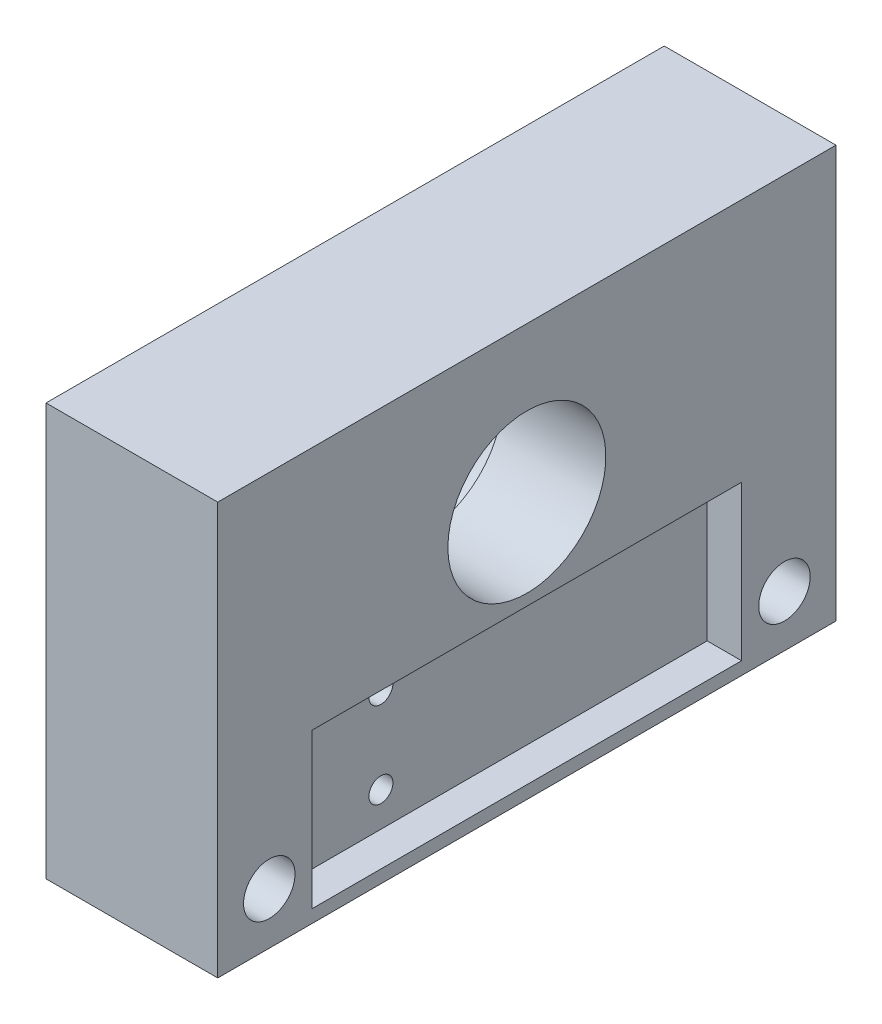
ISO-10303-21;
HEADER;
FILE_DESCRIPTION(('STEP AP214'),'2;1');
FILE_NAME('part.step','',(''),(''),'','','');
FILE_SCHEMA(('AUTOMOTIVE_DESIGN { 1 0 10303 214 1 1 1 1 }'));
ENDSEC;
DATA;
#1=APPLICATION_CONTEXT('core data for automotive mechanical design processes');
#2=APPLICATION_PROTOCOL_DEFINITION('international standard','automotive_design',2000,#1);
#3=PRODUCT_CONTEXT('',#1,'mechanical');
#4=PRODUCT('Part','Part','',(#3));
#5=PRODUCT_RELATED_PRODUCT_CATEGORY('part','',(#4));
#6=PRODUCT_DEFINITION_FORMATION('','',#4);
#7=PRODUCT_DEFINITION_CONTEXT('part definition',#1,'design');
#8=PRODUCT_DEFINITION('design','',#6,#7);
#9=PRODUCT_DEFINITION_SHAPE('','',#8);
#10=(LENGTH_UNIT() NAMED_UNIT(*) SI_UNIT(.MILLI.,.METRE.));
#11=(NAMED_UNIT(*) PLANE_ANGLE_UNIT() SI_UNIT($,.RADIAN.));
#12=(NAMED_UNIT(*) SI_UNIT($,.STERADIAN.) SOLID_ANGLE_UNIT());
#13=UNCERTAINTY_MEASURE_WITH_UNIT(LENGTH_MEASURE(1.E-05),#10,'distance_accuracy_value','');
#14=(GEOMETRIC_REPRESENTATION_CONTEXT(3) GLOBAL_UNCERTAINTY_ASSIGNED_CONTEXT((#13)) GLOBAL_UNIT_ASSIGNED_CONTEXT((#10,
#11,#12)) REPRESENTATION_CONTEXT('',''));
#15=CARTESIAN_POINT('',(0.,0.,0.));
#16=DIRECTION('',(0.,0.,1.));
#17=DIRECTION('',(1.,0.,0.));
#18=AXIS2_PLACEMENT_3D('',#15,#16,#17);
#19=CARTESIAN_POINT('',(10.,0.,0.));
#20=DIRECTION('',(0.,0.,-1.));
#21=DIRECTION('',(0.,1.,0.));
#22=AXIS2_PLACEMENT_3D('',#19,#20,#21);
#23=PLANE('',#22);
#24=DIRECTION('',(0.,-1.,0.));
#25=VECTOR('',#24,1.);
#26=CARTESIAN_POINT('',(0.,0.,0.));
#27=LINE('',#26,#25);
#28=CARTESIAN_POINT('',(0.,0.,0.));
#29=VERTEX_POINT('',#28);
#30=CARTESIAN_POINT('',(0.,-24.,0.));
#31=VERTEX_POINT('',#30);
#32=EDGE_CURVE('E175',#29,#31,#27,.T.);
#33=ORIENTED_EDGE('',*,*,#32,.T.);
#34=DIRECTION('',(-1.,0.,0.));
#35=VECTOR('',#34,1.);
#36=CARTESIAN_POINT('',(10.,-24.,0.));
#37=LINE('',#36,#35);
#38=CARTESIAN_POINT('',(10.,-24.,0.));
#39=VERTEX_POINT('',#38);
#40=EDGE_CURVE('E11',#39,#31,#37,.T.);
#41=ORIENTED_EDGE('',*,*,#40,.F.);
#42=DIRECTION('',(0.,-1.,0.));
#43=VECTOR('',#42,1.);
#44=CARTESIAN_POINT('',(10.,0.,0.));
#45=LINE('',#44,#43);
#46=CARTESIAN_POINT('',(10.,0.,0.));
#47=VERTEX_POINT('',#46);
#48=EDGE_CURVE('E178',#47,#39,#45,.T.);
#49=ORIENTED_EDGE('',*,*,#48,.F.);
#50=DIRECTION('',(-1.,0.,0.));
#51=VECTOR('',#50,1.);
#52=CARTESIAN_POINT('',(10.,0.,0.));
#53=LINE('',#52,#51);
#54=EDGE_CURVE('E184',#47,#29,#53,.T.);
#55=ORIENTED_EDGE('',*,*,#54,.T.);
#56=EDGE_LOOP('',(#33,#41,#49,#55));
#57=FACE_BOUND('',#56,.T.);
#58=ADVANCED_FACE('F38',(#57),#23,.F.);
#59=CARTESIAN_POINT('',(10.,-24.,0.));
#60=DIRECTION('',(0.,1.,0.));
#61=DIRECTION('',(0.,0.,1.));
#62=AXIS2_PLACEMENT_3D('',#59,#60,#61);
#63=PLANE('',#62);
#64=CARTESIAN_POINT('',(5.,-24.,-28.));
#65=DIRECTION('',(0.,-1.,0.));
#66=DIRECTION('',(0.,0.,-1.));
#67=AXIS2_PLACEMENT_3D('',#64,#65,#66);
#68=CIRCLE('',#67,2.5);
#69=CARTESIAN_POINT('',(5.,-24.,-30.5));
#70=VERTEX_POINT('',#69);
#71=EDGE_CURVE('E158',#70,#70,#68,.T.);
#72=ORIENTED_EDGE('',*,*,#71,.F.);
#73=EDGE_LOOP('',(#72));
#74=FACE_BOUND('',#73,.T.);
#75=CARTESIAN_POINT('',(5.,-24.,-8.));
#76=DIRECTION('',(0.,-1.,0.));
#77=DIRECTION('',(0.,0.,-1.));
#78=AXIS2_PLACEMENT_3D('',#75,#76,#77);
#79=CIRCLE('',#78,2.5);
#80=CARTESIAN_POINT('',(5.,-24.,-10.5));
#81=VERTEX_POINT('',#80);
#82=EDGE_CURVE('E150',#81,#81,#79,.T.);
#83=ORIENTED_EDGE('',*,*,#82,.F.);
#84=EDGE_LOOP('',(#83));
#85=FACE_BOUND('',#84,.T.);
#86=DIRECTION('',(0.,0.,-1.));
#87=VECTOR('',#86,1.);
#88=CARTESIAN_POINT('',(0.,-24.,0.));
#89=LINE('',#88,#87);
#90=CARTESIAN_POINT('',(0.,-24.,-36.));
#91=VERTEX_POINT('',#90);
#92=EDGE_CURVE('E187',#31,#91,#89,.T.);
#93=ORIENTED_EDGE('',*,*,#92,.T.);
#94=DIRECTION('',(-1.,0.,0.));
#95=VECTOR('',#94,1.);
#96=CARTESIAN_POINT('',(10.,-24.,-36.));
#97=LINE('',#96,#95);
#98=CARTESIAN_POINT('',(10.,-24.,-36.));
#99=VERTEX_POINT('',#98);
#100=EDGE_CURVE('E45',#99,#91,#97,.T.);
#101=ORIENTED_EDGE('',*,*,#100,.F.);
#102=DIRECTION('',(0.,0.,-1.));
#103=VECTOR('',#102,1.);
#104=CARTESIAN_POINT('',(10.,-24.,0.));
#105=LINE('',#104,#103);
#106=EDGE_CURVE('E89',#39,#99,#105,.T.);
#107=ORIENTED_EDGE('',*,*,#106,.F.);
#108=ORIENTED_EDGE('',*,*,#40,.T.);
#109=EDGE_LOOP('',(#93,#101,#107,#108));
#110=FACE_BOUND('',#109,.T.);
#111=ADVANCED_FACE('F216',(#74,#85,#110),#63,.F.);
#112=CARTESIAN_POINT('',(10.,0.,-36.));
#113=DIRECTION('',(0.,0.,1.));
#114=DIRECTION('',(1.,0.,0.));
#115=AXIS2_PLACEMENT_3D('',#112,#113,#114);
#116=PLANE('',#115);
#117=DIRECTION('',(0.,1.,0.));
#118=VECTOR('',#117,1.);
#119=CARTESIAN_POINT('',(0.,0.,-36.));
#120=LINE('',#119,#118);
#121=CARTESIAN_POINT('',(0.,0.,-36.));
#122=VERTEX_POINT('',#121);
#123=EDGE_CURVE('E189',#91,#122,#120,.T.);
#124=ORIENTED_EDGE('',*,*,#123,.T.);
#125=DIRECTION('',(-1.,0.,0.));
#126=VECTOR('',#125,1.);
#127=CARTESIAN_POINT('',(10.,0.,-36.));
#128=LINE('',#127,#126);
#129=CARTESIAN_POINT('',(10.,0.,-36.));
#130=VERTEX_POINT('',#129);
#131=EDGE_CURVE('E193',#130,#122,#128,.T.);
#132=ORIENTED_EDGE('',*,*,#131,.F.);
#133=DIRECTION('',(0.,1.,0.));
#134=VECTOR('',#133,1.);
#135=CARTESIAN_POINT('',(10.,0.,-36.));
#136=LINE('',#135,#134);
#137=EDGE_CURVE('E181',#99,#130,#136,.T.);
#138=ORIENTED_EDGE('',*,*,#137,.F.);
#139=ORIENTED_EDGE('',*,*,#100,.T.);
#140=EDGE_LOOP('',(#124,#132,#138,#139));
#141=FACE_BOUND('',#140,.T.);
#142=ADVANCED_FACE('F198',(#141),#116,.F.);
#143=CARTESIAN_POINT('',(10.,0.,0.));
#144=DIRECTION('',(0.,-1.,0.));
#145=DIRECTION('',(0.,0.,-1.));
#146=AXIS2_PLACEMENT_3D('',#143,#144,#145);
#147=PLANE('',#146);
#148=DIRECTION('',(0.,0.,1.));
#149=VECTOR('',#148,1.);
#150=CARTESIAN_POINT('',(0.,0.,0.));
#151=LINE('',#150,#149);
#152=EDGE_CURVE('E82',#122,#29,#151,.T.);
#153=ORIENTED_EDGE('',*,*,#152,.T.);
#154=ORIENTED_EDGE('',*,*,#54,.F.);
#155=DIRECTION('',(0.,0.,1.));
#156=VECTOR('',#155,1.);
#157=CARTESIAN_POINT('',(10.,0.,0.));
#158=LINE('',#157,#156);
#159=EDGE_CURVE('E61',#130,#47,#158,.T.);
#160=ORIENTED_EDGE('',*,*,#159,.F.);
#161=ORIENTED_EDGE('',*,*,#131,.T.);
#162=EDGE_LOOP('',(#153,#154,#160,#161));
#163=FACE_BOUND('',#162,.T.);
#164=ADVANCED_FACE('F206',(#163),#147,.F.);
#165=CARTESIAN_POINT('',(10.,0.,0.));
#166=DIRECTION('',(1.,0.,0.));
#167=DIRECTION('',(0.,0.,-1.));
#168=AXIS2_PLACEMENT_3D('',#165,#166,#167);
#169=PLANE('',#168);
#170=CARTESIAN_POINT('',(10.,-21.,-3.));
#171=DIRECTION('',(1.,0.,0.));
#172=DIRECTION('',(0.,0.,-1.));
#173=AXIS2_PLACEMENT_3D('',#170,#171,#172);
#174=CIRCLE('',#173,1.5);
#175=CARTESIAN_POINT('',(10.,-21.,-4.5));
#176=VERTEX_POINT('',#175);
#177=EDGE_CURVE('E289',#176,#176,#174,.T.);
#178=ORIENTED_EDGE('',*,*,#177,.F.);
#179=EDGE_LOOP('',(#178));
#180=FACE_BOUND('',#179,.T.);
#181=CARTESIAN_POINT('',(10.,-21.,-33.));
#182=DIRECTION('',(1.,0.,0.));
#183=DIRECTION('',(0.,0.,-1.));
#184=AXIS2_PLACEMENT_3D('',#181,#182,#183);
#185=CIRCLE('',#184,1.5);
#186=CARTESIAN_POINT('',(10.,-21.,-34.5));
#187=VERTEX_POINT('',#186);
#188=EDGE_CURVE('E301',#187,#187,#185,.T.);
#189=ORIENTED_EDGE('',*,*,#188,.F.);
#190=EDGE_LOOP('',(#189));
#191=FACE_BOUND('',#190,.T.);
#192=DIRECTION('',(0.,-1.,0.));
#193=VECTOR('',#192,1.);
#194=CARTESIAN_POINT('',(10.,-14.25,-5.5));
#195=LINE('',#194,#193);
#196=CARTESIAN_POINT('',(10.,-14.25,-5.5));
#197=VERTEX_POINT('',#196);
#198=CARTESIAN_POINT('',(10.,-23.25,-5.5));
#199=VERTEX_POINT('',#198);
#200=EDGE_CURVE('E52',#197,#199,#195,.T.);
#201=ORIENTED_EDGE('',*,*,#200,.F.);
#202=DIRECTION('',(0.,0.,1.));
#203=VECTOR('',#202,1.);
#204=CARTESIAN_POINT('',(10.,-14.25,-5.5));
#205=LINE('',#204,#203);
#206=CARTESIAN_POINT('',(10.,-14.25,-30.5));
#207=VERTEX_POINT('',#206);
#208=EDGE_CURVE('E131',#207,#197,#205,.T.);
#209=ORIENTED_EDGE('',*,*,#208,.F.);
#210=DIRECTION('',(0.,1.,0.));
#211=VECTOR('',#210,1.);
#212=CARTESIAN_POINT('',(10.,-14.25,-30.5));
#213=LINE('',#212,#211);
#214=CARTESIAN_POINT('',(10.,-23.25,-30.5));
#215=VERTEX_POINT('',#214);
#216=EDGE_CURVE('E134',#215,#207,#213,.T.);
#217=ORIENTED_EDGE('',*,*,#216,.F.);
#218=DIRECTION('',(0.,0.,-1.));
#219=VECTOR('',#218,1.);
#220=CARTESIAN_POINT('',(10.,-23.25,-5.5));
#221=LINE('',#220,#219);
#222=EDGE_CURVE('E143',#199,#215,#221,.T.);
#223=ORIENTED_EDGE('',*,*,#222,.F.);
#224=EDGE_LOOP('',(#201,#209,#217,#223));
#225=FACE_BOUND('',#224,.T.);
#226=CARTESIAN_POINT('',(10.,-9.,-18.));
#227=DIRECTION('',(-1.,0.,0.));
#228=DIRECTION('',(0.,0.,1.));
#229=AXIS2_PLACEMENT_3D('',#226,#227,#228);
#230=CIRCLE('',#229,4.6);
#231=CARTESIAN_POINT('',(10.,-9.,-13.4));
#232=VERTEX_POINT('',#231);
#233=EDGE_CURVE('E166',#232,#232,#230,.T.);
#234=ORIENTED_EDGE('',*,*,#233,.T.);
#235=EDGE_LOOP('',(#234));
#236=FACE_BOUND('',#235,.T.);
#237=ORIENTED_EDGE('',*,*,#48,.T.);
#238=ORIENTED_EDGE('',*,*,#106,.T.);
#239=ORIENTED_EDGE('',*,*,#137,.T.);
#240=ORIENTED_EDGE('',*,*,#159,.T.);
#241=EDGE_LOOP('',(#237,#238,#239,#240));
#242=FACE_BOUND('',#241,.T.);
#243=ADVANCED_FACE('F208',(#180,#191,#225,#236,#242),#169,.T.);
#244=CARTESIAN_POINT('',(0.,0.,0.));
#245=DIRECTION('',(1.,0.,0.));
#246=DIRECTION('',(0.,0.,-1.));
#247=AXIS2_PLACEMENT_3D('',#244,#245,#246);
#248=PLANE('',#247);
#249=CARTESIAN_POINT('',(0.,-3.,-3.5));
#250=DIRECTION('',(-1.,0.,0.));
#251=DIRECTION('',(0.,0.,1.));
#252=AXIS2_PLACEMENT_3D('',#249,#250,#251);
#253=CIRCLE('',#252,1.);
#254=CARTESIAN_POINT('',(0.,-3.,-2.5));
#255=VERTEX_POINT('',#254);
#256=EDGE_CURVE('E262',#255,#255,#253,.T.);
#257=ORIENTED_EDGE('',*,*,#256,.F.);
#258=EDGE_LOOP('',(#257));
#259=FACE_BOUND('',#258,.T.);
#260=CARTESIAN_POINT('',(0.,-21.,-3.5));
#261=DIRECTION('',(-1.,0.,0.));
#262=DIRECTION('',(0.,0.,1.));
#263=AXIS2_PLACEMENT_3D('',#260,#261,#262);
#264=CIRCLE('',#263,1.);
#265=CARTESIAN_POINT('',(0.,-21.,-2.5));
#266=VERTEX_POINT('',#265);
#267=EDGE_CURVE('E266',#266,#266,#264,.T.);
#268=ORIENTED_EDGE('',*,*,#267,.F.);
#269=EDGE_LOOP('',(#268));
#270=FACE_BOUND('',#269,.T.);
#271=CARTESIAN_POINT('',(0.,-21.,-32.5));
#272=DIRECTION('',(-1.,0.,0.));
#273=DIRECTION('',(0.,0.,1.));
#274=AXIS2_PLACEMENT_3D('',#271,#272,#273);
#275=CIRCLE('',#274,0.999999999999998);
#276=CARTESIAN_POINT('',(0.,-21.,-31.5));
#277=VERTEX_POINT('',#276);
#278=EDGE_CURVE('E270',#277,#277,#275,.T.);
#279=ORIENTED_EDGE('',*,*,#278,.F.);
#280=EDGE_LOOP('',(#279));
#281=FACE_BOUND('',#280,.T.);
#282=CARTESIAN_POINT('',(0.,-3.,-32.5));
#283=DIRECTION('',(-1.,0.,0.));
#284=DIRECTION('',(0.,0.,1.));
#285=AXIS2_PLACEMENT_3D('',#282,#283,#284);
#286=CIRCLE('',#285,0.999999999999998);
#287=CARTESIAN_POINT('',(0.,-3.,-31.5));
#288=VERTEX_POINT('',#287);
#289=EDGE_CURVE('E274',#288,#288,#286,.T.);
#290=ORIENTED_EDGE('',*,*,#289,.F.);
#291=EDGE_LOOP('',(#290));
#292=FACE_BOUND('',#291,.T.);
#293=CARTESIAN_POINT('',(0.,-9.,-10.));
#294=DIRECTION('',(-1.,0.,0.));
#295=DIRECTION('',(0.,0.,1.));
#296=AXIS2_PLACEMENT_3D('',#293,#294,#295);
#297=CIRCLE('',#296,1.5);
#298=CARTESIAN_POINT('',(0.,-9.,-8.5));
#299=VERTEX_POINT('',#298);
#300=EDGE_CURVE('E278',#299,#299,#297,.T.);
#301=ORIENTED_EDGE('',*,*,#300,.F.);
#302=EDGE_LOOP('',(#301));
#303=FACE_BOUND('',#302,.T.);
#304=CARTESIAN_POINT('',(0.,-9.,-26.));
#305=DIRECTION('',(-1.,0.,0.));
#306=DIRECTION('',(0.,0.,1.));
#307=AXIS2_PLACEMENT_3D('',#304,#305,#306);
#308=CIRCLE('',#307,1.5);
#309=CARTESIAN_POINT('',(0.,-9.,-24.5));
#310=VERTEX_POINT('',#309);
#311=EDGE_CURVE('E137',#310,#310,#308,.T.);
#312=ORIENTED_EDGE('',*,*,#311,.F.);
#313=EDGE_LOOP('',(#312));
#314=FACE_BOUND('',#313,.T.);
#315=CARTESIAN_POINT('',(0.,-9.,-18.));
#316=DIRECTION('',(-1.,0.,0.));
#317=DIRECTION('',(0.,0.,1.));
#318=AXIS2_PLACEMENT_3D('',#315,#316,#317);
#319=CIRCLE('',#318,6.05);
#320=CARTESIAN_POINT('',(0.,-9.,-11.95));
#321=VERTEX_POINT('',#320);
#322=EDGE_CURVE('E169',#321,#321,#319,.T.);
#323=ORIENTED_EDGE('',*,*,#322,.F.);
#324=EDGE_LOOP('',(#323));
#325=FACE_BOUND('',#324,.T.);
#326=ORIENTED_EDGE('',*,*,#32,.F.);
#327=ORIENTED_EDGE('',*,*,#152,.F.);
#328=ORIENTED_EDGE('',*,*,#123,.F.);
#329=ORIENTED_EDGE('',*,*,#92,.F.);
#330=EDGE_LOOP('',(#326,#327,#328,#329));
#331=FACE_BOUND('',#330,.T.);
#332=ADVANCED_FACE('F202',(#259,#270,#281,#292,#303,#314,#325,#331),#248,.F.);
#333=CARTESIAN_POINT('',(4.,-9.,-18.));
#334=DIRECTION('',(-1.,0.,0.));
#335=DIRECTION('',(0.,0.,1.));
#336=AXIS2_PLACEMENT_3D('',#333,#334,#335);
#337=CYLINDRICAL_SURFACE('',#336,6.05);
#338=CARTESIAN_POINT('',(4.,-9.,-18.));
#339=DIRECTION('',(-1.,0.,0.));
#340=DIRECTION('',(0.,0.,1.));
#341=AXIS2_PLACEMENT_3D('',#338,#339,#340);
#342=CIRCLE('',#341,6.05);
#343=CARTESIAN_POINT('',(4.,-9.,-11.95));
#344=VERTEX_POINT('',#343);
#345=EDGE_CURVE('E172',#344,#344,#342,.T.);
#346=ORIENTED_EDGE('',*,*,#345,.F.);
#347=EDGE_LOOP('',(#346));
#348=FACE_BOUND('',#347,.T.);
#349=ORIENTED_EDGE('',*,*,#322,.T.);
#350=EDGE_LOOP('',(#349));
#351=FACE_BOUND('',#350,.T.);
#352=ADVANCED_FACE('F251',(#348,#351),#337,.F.);
#353=CARTESIAN_POINT('',(4.,-9.,-18.));
#354=DIRECTION('',(-1.,0.,0.));
#355=DIRECTION('',(0.,0.,1.));
#356=AXIS2_PLACEMENT_3D('',#353,#354,#355);
#357=PLANE('',#356);
#358=CARTESIAN_POINT('',(4.,-9.,-18.));
#359=DIRECTION('',(-1.,0.,0.));
#360=DIRECTION('',(0.,0.,1.));
#361=AXIS2_PLACEMENT_3D('',#358,#359,#360);
#362=CIRCLE('',#361,4.6);
#363=CARTESIAN_POINT('',(4.,-9.,-13.4));
#364=VERTEX_POINT('',#363);
#365=EDGE_CURVE('E157',#364,#364,#362,.T.);
#366=ORIENTED_EDGE('',*,*,#365,.F.);
#367=EDGE_LOOP('',(#366));
#368=FACE_BOUND('',#367,.T.);
#369=ORIENTED_EDGE('',*,*,#345,.T.);
#370=EDGE_LOOP('',(#369));
#371=FACE_BOUND('',#370,.T.);
#372=ADVANCED_FACE('F243',(#368,#371),#357,.T.);
#373=CARTESIAN_POINT('',(10.,-9.,-18.));
#374=DIRECTION('',(-1.,0.,0.));
#375=DIRECTION('',(0.,0.,1.));
#376=AXIS2_PLACEMENT_3D('',#373,#374,#375);
#377=CYLINDRICAL_SURFACE('',#376,4.6);
#378=ORIENTED_EDGE('',*,*,#233,.F.);
#379=EDGE_LOOP('',(#378));
#380=FACE_BOUND('',#379,.T.);
#381=ORIENTED_EDGE('',*,*,#365,.T.);
#382=EDGE_LOOP('',(#381));
#383=FACE_BOUND('',#382,.T.);
#384=ADVANCED_FACE('F233',(#380,#383),#377,.F.);
#385=CARTESIAN_POINT('',(5.,-16.,-8.));
#386=DIRECTION('',(0.,-1.,0.));
#387=DIRECTION('',(0.,0.,-1.));
#388=AXIS2_PLACEMENT_3D('',#385,#386,#387);
#389=CYLINDRICAL_SURFACE('',#388,2.5);
#390=CARTESIAN_POINT('',(5.,-16.,-8.));
#391=DIRECTION('',(0.,-1.,0.));
#392=DIRECTION('',(0.,0.,-1.));
#393=AXIS2_PLACEMENT_3D('',#390,#391,#392);
#394=CIRCLE('',#393,2.5);
#395=CARTESIAN_POINT('',(5.,-16.,-10.5));
#396=VERTEX_POINT('',#395);
#397=EDGE_CURVE('E161',#396,#396,#394,.T.);
#398=ORIENTED_EDGE('',*,*,#397,.F.);
#399=EDGE_LOOP('',(#398));
#400=FACE_BOUND('',#399,.T.);
#401=ORIENTED_EDGE('',*,*,#82,.T.);
#402=EDGE_LOOP('',(#401));
#403=FACE_BOUND('',#402,.T.);
#404=ADVANCED_FACE('F230',(#400,#403),#389,.F.);
#405=CARTESIAN_POINT('',(5.,-16.,-8.));
#406=DIRECTION('',(0.,-1.,0.));
#407=DIRECTION('',(0.,0.,-1.));
#408=AXIS2_PLACEMENT_3D('',#405,#406,#407);
#409=PLANE('',#408);
#410=ORIENTED_EDGE('',*,*,#397,.T.);
#411=EDGE_LOOP('',(#410));
#412=FACE_BOUND('',#411,.T.);
#413=ADVANCED_FACE('F232',(#412),#409,.T.);
#414=CARTESIAN_POINT('',(5.,-16.,-28.));
#415=DIRECTION('',(0.,-1.,0.));
#416=DIRECTION('',(0.,0.,-1.));
#417=AXIS2_PLACEMENT_3D('',#414,#415,#416);
#418=CYLINDRICAL_SURFACE('',#417,2.5);
#419=CARTESIAN_POINT('',(5.,-16.,-28.));
#420=DIRECTION('',(0.,-1.,0.));
#421=DIRECTION('',(0.,0.,-1.));
#422=AXIS2_PLACEMENT_3D('',#419,#420,#421);
#423=CIRCLE('',#422,2.5);
#424=CARTESIAN_POINT('',(5.,-16.,-30.5));
#425=VERTEX_POINT('',#424);
#426=EDGE_CURVE('E154',#425,#425,#423,.T.);
#427=ORIENTED_EDGE('',*,*,#426,.F.);
#428=EDGE_LOOP('',(#427));
#429=FACE_BOUND('',#428,.T.);
#430=ORIENTED_EDGE('',*,*,#71,.T.);
#431=EDGE_LOOP('',(#430));
#432=FACE_BOUND('',#431,.T.);
#433=ADVANCED_FACE('F240',(#429,#432),#418,.F.);
#434=CARTESIAN_POINT('',(5.,-16.,-28.));
#435=DIRECTION('',(0.,-1.,0.));
#436=DIRECTION('',(0.,0.,-1.));
#437=AXIS2_PLACEMENT_3D('',#434,#435,#436);
#438=PLANE('',#437);
#439=ORIENTED_EDGE('',*,*,#426,.T.);
#440=EDGE_LOOP('',(#439));
#441=FACE_BOUND('',#440,.T.);
#442=ADVANCED_FACE('F345',(#441),#438,.T.);
#443=CARTESIAN_POINT('',(8.,-14.25,-5.5));
#444=DIRECTION('',(0.,0.,1.));
#445=DIRECTION('',(0.,-1.,0.));
#446=AXIS2_PLACEMENT_3D('',#443,#444,#445);
#447=PLANE('',#446);
#448=ORIENTED_EDGE('',*,*,#200,.T.);
#449=DIRECTION('',(1.,0.,0.));
#450=VECTOR('',#449,1.);
#451=CARTESIAN_POINT('',(8.,-23.25,-5.5));
#452=LINE('',#451,#450);
#453=CARTESIAN_POINT('',(8.,-23.25,-5.5));
#454=VERTEX_POINT('',#453);
#455=EDGE_CURVE('E109',#454,#199,#452,.T.);
#456=ORIENTED_EDGE('',*,*,#455,.F.);
#457=DIRECTION('',(0.,-1.,0.));
#458=VECTOR('',#457,1.);
#459=CARTESIAN_POINT('',(8.,-14.25,-5.5));
#460=LINE('',#459,#458);
#461=CARTESIAN_POINT('',(8.,-14.25,-5.5));
#462=VERTEX_POINT('',#461);
#463=EDGE_CURVE('E113',#462,#454,#460,.T.);
#464=ORIENTED_EDGE('',*,*,#463,.F.);
#465=DIRECTION('',(1.,0.,0.));
#466=VECTOR('',#465,1.);
#467=CARTESIAN_POINT('',(8.,-14.25,-5.5));
#468=LINE('',#467,#466);
#469=EDGE_CURVE('E148',#462,#197,#468,.T.);
#470=ORIENTED_EDGE('',*,*,#469,.T.);
#471=EDGE_LOOP('',(#448,#456,#464,#470));
#472=FACE_BOUND('',#471,.T.);
#473=ADVANCED_FACE('F111',(#472),#447,.F.);
#474=CARTESIAN_POINT('',(8.,-14.25,-5.5));
#475=DIRECTION('',(0.,1.,0.));
#476=DIRECTION('',(0.,0.,1.));
#477=AXIS2_PLACEMENT_3D('',#474,#475,#476);
#478=PLANE('',#477);
#479=ORIENTED_EDGE('',*,*,#208,.T.);
#480=ORIENTED_EDGE('',*,*,#469,.F.);
#481=DIRECTION('',(0.,0.,1.));
#482=VECTOR('',#481,1.);
#483=CARTESIAN_POINT('',(8.,-14.25,-5.5));
#484=LINE('',#483,#482);
#485=CARTESIAN_POINT('',(8.,-14.25,-30.5));
#486=VERTEX_POINT('',#485);
#487=EDGE_CURVE('E119',#486,#462,#484,.T.);
#488=ORIENTED_EDGE('',*,*,#487,.F.);
#489=DIRECTION('',(1.,0.,0.));
#490=VECTOR('',#489,1.);
#491=CARTESIAN_POINT('',(8.,-14.25,-30.5));
#492=LINE('',#491,#490);
#493=EDGE_CURVE('E151',#486,#207,#492,.T.);
#494=ORIENTED_EDGE('',*,*,#493,.T.);
#495=EDGE_LOOP('',(#479,#480,#488,#494));
#496=FACE_BOUND('',#495,.T.);
#497=ADVANCED_FACE('F333',(#496),#478,.F.);
#498=CARTESIAN_POINT('',(8.,-14.25,-30.5));
#499=DIRECTION('',(0.,0.,-1.));
#500=DIRECTION('',(-1.,0.,0.));
#501=AXIS2_PLACEMENT_3D('',#498,#499,#500);
#502=PLANE('',#501);
#503=ORIENTED_EDGE('',*,*,#216,.T.);
#504=ORIENTED_EDGE('',*,*,#493,.F.);
#505=DIRECTION('',(0.,1.,0.));
#506=VECTOR('',#505,1.);
#507=CARTESIAN_POINT('',(8.,-14.25,-30.5));
#508=LINE('',#507,#506);
#509=CARTESIAN_POINT('',(8.,-23.25,-30.5));
#510=VERTEX_POINT('',#509);
#511=EDGE_CURVE('E127',#510,#486,#508,.T.);
#512=ORIENTED_EDGE('',*,*,#511,.F.);
#513=DIRECTION('',(1.,0.,0.));
#514=VECTOR('',#513,1.);
#515=CARTESIAN_POINT('',(8.,-23.25,-30.5));
#516=LINE('',#515,#514);
#517=EDGE_CURVE('E118',#510,#215,#516,.T.);
#518=ORIENTED_EDGE('',*,*,#517,.T.);
#519=EDGE_LOOP('',(#503,#504,#512,#518));
#520=FACE_BOUND('',#519,.T.);
#521=ADVANCED_FACE('F336',(#520),#502,.F.);
#522=CARTESIAN_POINT('',(8.,-23.25,-5.5));
#523=DIRECTION('',(0.,-1.,0.));
#524=DIRECTION('',(0.,0.,-1.));
#525=AXIS2_PLACEMENT_3D('',#522,#523,#524);
#526=PLANE('',#525);
#527=ORIENTED_EDGE('',*,*,#222,.T.);
#528=ORIENTED_EDGE('',*,*,#517,.F.);
#529=DIRECTION('',(0.,0.,-1.));
#530=VECTOR('',#529,1.);
#531=CARTESIAN_POINT('',(8.,-23.25,-5.5));
#532=LINE('',#531,#530);
#533=EDGE_CURVE('E122',#454,#510,#532,.T.);
#534=ORIENTED_EDGE('',*,*,#533,.F.);
#535=ORIENTED_EDGE('',*,*,#455,.T.);
#536=EDGE_LOOP('',(#527,#528,#534,#535));
#537=FACE_BOUND('',#536,.T.);
#538=ADVANCED_FACE('F123',(#537),#526,.F.);
#539=CARTESIAN_POINT('',(8.,0.,0.));
#540=DIRECTION('',(1.,0.,0.));
#541=DIRECTION('',(0.,0.,-1.));
#542=AXIS2_PLACEMENT_3D('',#539,#540,#541);
#543=PLANE('',#542);
#544=CARTESIAN_POINT('',(8.,-16.25,-11.5));
#545=DIRECTION('',(1.,0.,0.));
#546=DIRECTION('',(0.,0.,-1.));
#547=AXIS2_PLACEMENT_3D('',#544,#545,#546);
#548=CIRCLE('',#547,0.699999999999999);
#549=CARTESIAN_POINT('',(8.,-16.25,-12.2));
#550=VERTEX_POINT('',#549);
#551=EDGE_CURVE('E574',#550,#550,#548,.T.);
#552=ORIENTED_EDGE('',*,*,#551,.F.);
#553=EDGE_LOOP('',(#552));
#554=FACE_BOUND('',#553,.T.);
#555=CARTESIAN_POINT('',(8.,-21.25,-11.5));
#556=DIRECTION('',(1.,0.,0.));
#557=DIRECTION('',(0.,0.,-1.));
#558=AXIS2_PLACEMENT_3D('',#555,#556,#557);
#559=CIRCLE('',#558,0.699999999999999);
#560=CARTESIAN_POINT('',(8.,-21.25,-12.2));
#561=VERTEX_POINT('',#560);
#562=EDGE_CURVE('E584',#561,#561,#559,.T.);
#563=ORIENTED_EDGE('',*,*,#562,.F.);
#564=EDGE_LOOP('',(#563));
#565=FACE_BOUND('',#564,.T.);
#566=ORIENTED_EDGE('',*,*,#463,.T.);
#567=ORIENTED_EDGE('',*,*,#533,.T.);
#568=ORIENTED_EDGE('',*,*,#511,.T.);
#569=ORIENTED_EDGE('',*,*,#487,.T.);
#570=EDGE_LOOP('',(#566,#567,#568,#569));
#571=FACE_BOUND('',#570,.T.);
#572=ADVANCED_FACE('F129',(#554,#565,#571),#543,.T.);
#573=CARTESIAN_POINT('',(5.,-9.,-26.));
#574=DIRECTION('',(-1.,0.,0.));
#575=DIRECTION('',(0.,0.,1.));
#576=AXIS2_PLACEMENT_3D('',#573,#574,#575);
#577=CYLINDRICAL_SURFACE('',#576,1.5);
#578=CARTESIAN_POINT('',(5.,-9.,-26.));
#579=DIRECTION('',(-1.,0.,0.));
#580=DIRECTION('',(0.,0.,1.));
#581=AXIS2_PLACEMENT_3D('',#578,#579,#580);
#582=CIRCLE('',#581,1.5);
#583=CARTESIAN_POINT('',(5.,-9.,-24.5));
#584=VERTEX_POINT('',#583);
#585=EDGE_CURVE('E285',#584,#584,#582,.T.);
#586=ORIENTED_EDGE('',*,*,#585,.F.);
#587=EDGE_LOOP('',(#586));
#588=FACE_BOUND('',#587,.T.);
#589=ORIENTED_EDGE('',*,*,#311,.T.);
#590=EDGE_LOOP('',(#589));
#591=FACE_BOUND('',#590,.T.);
#592=ADVANCED_FACE('F321',(#588,#591),#577,.F.);
#593=CARTESIAN_POINT('',(5.,-9.,-26.));
#594=DIRECTION('',(-1.,0.,0.));
#595=DIRECTION('',(0.,0.,1.));
#596=AXIS2_PLACEMENT_3D('',#593,#594,#595);
#597=PLANE('',#596);
#598=ORIENTED_EDGE('',*,*,#585,.T.);
#599=EDGE_LOOP('',(#598));
#600=FACE_BOUND('',#599,.T.);
#601=ADVANCED_FACE('F311',(#600),#597,.T.);
#602=CARTESIAN_POINT('',(5.,-9.,-10.));
#603=DIRECTION('',(-1.,0.,0.));
#604=DIRECTION('',(0.,0.,1.));
#605=AXIS2_PLACEMENT_3D('',#602,#603,#604);
#606=CYLINDRICAL_SURFACE('',#605,1.5);
#607=CARTESIAN_POINT('',(5.,-9.,-10.));
#608=DIRECTION('',(-1.,0.,0.));
#609=DIRECTION('',(0.,0.,1.));
#610=AXIS2_PLACEMENT_3D('',#607,#608,#609);
#611=CIRCLE('',#610,1.5);
#612=CARTESIAN_POINT('',(5.,-9.,-8.5));
#613=VERTEX_POINT('',#612);
#614=EDGE_CURVE('E144',#613,#613,#611,.T.);
#615=ORIENTED_EDGE('',*,*,#614,.F.);
#616=EDGE_LOOP('',(#615));
#617=FACE_BOUND('',#616,.T.);
#618=ORIENTED_EDGE('',*,*,#300,.T.);
#619=EDGE_LOOP('',(#618));
#620=FACE_BOUND('',#619,.T.);
#621=ADVANCED_FACE('F308',(#617,#620),#606,.F.);
#622=CARTESIAN_POINT('',(5.,-9.,-10.));
#623=DIRECTION('',(-1.,0.,0.));
#624=DIRECTION('',(0.,0.,1.));
#625=AXIS2_PLACEMENT_3D('',#622,#623,#624);
#626=PLANE('',#625);
#627=ORIENTED_EDGE('',*,*,#614,.T.);
#628=EDGE_LOOP('',(#627));
#629=FACE_BOUND('',#628,.T.);
#630=ADVANCED_FACE('F310',(#629),#626,.T.);
#631=CARTESIAN_POINT('',(5.,-21.,-33.));
#632=DIRECTION('',(1.,0.,0.));
#633=DIRECTION('',(0.,0.,-1.));
#634=AXIS2_PLACEMENT_3D('',#631,#632,#633);
#635=CYLINDRICAL_SURFACE('',#634,1.5);
#636=CARTESIAN_POINT('',(5.,-21.,-33.));
#637=DIRECTION('',(1.,0.,0.));
#638=DIRECTION('',(0.,0.,-1.));
#639=AXIS2_PLACEMENT_3D('',#636,#637,#638);
#640=CIRCLE('',#639,1.5);
#641=CARTESIAN_POINT('',(5.,-21.,-34.5));
#642=VERTEX_POINT('',#641);
#643=EDGE_CURVE('E294',#642,#642,#640,.T.);
#644=ORIENTED_EDGE('',*,*,#643,.F.);
#645=EDGE_LOOP('',(#644));
#646=FACE_BOUND('',#645,.T.);
#647=ORIENTED_EDGE('',*,*,#188,.T.);
#648=EDGE_LOOP('',(#647));
#649=FACE_BOUND('',#648,.T.);
#650=ADVANCED_FACE('F318',(#646,#649),#635,.F.);
#651=CARTESIAN_POINT('',(5.,-21.,-33.));
#652=DIRECTION('',(1.,0.,0.));
#653=DIRECTION('',(0.,0.,-1.));
#654=AXIS2_PLACEMENT_3D('',#651,#652,#653);
#655=PLANE('',#654);
#656=ORIENTED_EDGE('',*,*,#643,.T.);
#657=EDGE_LOOP('',(#656));
#658=FACE_BOUND('',#657,.T.);
#659=ADVANCED_FACE('F417',(#658),#655,.T.);
#660=CARTESIAN_POINT('',(5.,-21.,-3.));
#661=DIRECTION('',(1.,0.,0.));
#662=DIRECTION('',(0.,0.,-1.));
#663=AXIS2_PLACEMENT_3D('',#660,#661,#662);
#664=CYLINDRICAL_SURFACE('',#663,1.5);
#665=CARTESIAN_POINT('',(5.,-21.,-3.));
#666=DIRECTION('',(1.,0.,0.));
#667=DIRECTION('',(0.,0.,-1.));
#668=AXIS2_PLACEMENT_3D('',#665,#666,#667);
#669=CIRCLE('',#668,1.5);
#670=CARTESIAN_POINT('',(5.,-21.,-4.5));
#671=VERTEX_POINT('',#670);
#672=EDGE_CURVE('E286',#671,#671,#669,.T.);
#673=ORIENTED_EDGE('',*,*,#672,.F.);
#674=EDGE_LOOP('',(#673));
#675=FACE_BOUND('',#674,.T.);
#676=ORIENTED_EDGE('',*,*,#177,.T.);
#677=EDGE_LOOP('',(#676));
#678=FACE_BOUND('',#677,.T.);
#679=ADVANCED_FACE('F426',(#675,#678),#664,.F.);
#680=CARTESIAN_POINT('',(5.,-21.,-3.));
#681=DIRECTION('',(1.,0.,0.));
#682=DIRECTION('',(0.,0.,-1.));
#683=AXIS2_PLACEMENT_3D('',#680,#681,#682);
#684=PLANE('',#683);
#685=ORIENTED_EDGE('',*,*,#672,.T.);
#686=EDGE_LOOP('',(#685));
#687=FACE_BOUND('',#686,.T.);
#688=ADVANCED_FACE('F436',(#687),#684,.T.);
#689=CARTESIAN_POINT('',(3.,-3.,-32.5));
#690=DIRECTION('',(-1.,0.,0.));
#691=DIRECTION('',(0.,0.,1.));
#692=AXIS2_PLACEMENT_3D('',#689,#690,#691);
#693=CYLINDRICAL_SURFACE('',#692,0.999999999999998);
#694=CARTESIAN_POINT('',(3.,-3.,-32.5));
#695=DIRECTION('',(-1.,0.,0.));
#696=DIRECTION('',(0.,0.,1.));
#697=AXIS2_PLACEMENT_3D('',#694,#695,#696);
#698=CIRCLE('',#697,0.999999999999998);
#699=CARTESIAN_POINT('',(3.,-3.,-31.5));
#700=VERTEX_POINT('',#699);
#701=EDGE_CURVE('E304',#700,#700,#698,.T.);
#702=ORIENTED_EDGE('',*,*,#701,.F.);
#703=EDGE_LOOP('',(#702));
#704=FACE_BOUND('',#703,.T.);
#705=ORIENTED_EDGE('',*,*,#289,.T.);
#706=EDGE_LOOP('',(#705));
#707=FACE_BOUND('',#706,.T.);
#708=ADVANCED_FACE('F445',(#704,#707),#693,.F.);
#709=CARTESIAN_POINT('',(3.,-3.,-32.5));
#710=DIRECTION('',(-1.,0.,0.));
#711=DIRECTION('',(0.,0.,1.));
#712=AXIS2_PLACEMENT_3D('',#709,#710,#711);
#713=PLANE('',#712);
#714=ORIENTED_EDGE('',*,*,#701,.T.);
#715=EDGE_LOOP('',(#714));
#716=FACE_BOUND('',#715,.T.);
#717=ADVANCED_FACE('F459',(#716),#713,.T.);
#718=CARTESIAN_POINT('',(3.,-21.,-32.5));
#719=DIRECTION('',(-1.,0.,0.));
#720=DIRECTION('',(0.,0.,1.));
#721=AXIS2_PLACEMENT_3D('',#718,#719,#720);
#722=CYLINDRICAL_SURFACE('',#721,0.999999999999998);
#723=CARTESIAN_POINT('',(3.,-21.,-32.5));
#724=DIRECTION('',(-1.,0.,0.));
#725=DIRECTION('',(0.,0.,1.));
#726=AXIS2_PLACEMENT_3D('',#723,#724,#725);
#727=CIRCLE('',#726,0.999999999999998);
#728=CARTESIAN_POINT('',(3.,-21.,-31.5));
#729=VERTEX_POINT('',#728);
#730=EDGE_CURVE('E587',#729,#729,#727,.T.);
#731=ORIENTED_EDGE('',*,*,#730,.F.);
#732=EDGE_LOOP('',(#731));
#733=FACE_BOUND('',#732,.T.);
#734=ORIENTED_EDGE('',*,*,#278,.T.);
#735=EDGE_LOOP('',(#734));
#736=FACE_BOUND('',#735,.T.);
#737=ADVANCED_FACE('F469',(#733,#736),#722,.F.);
#738=CARTESIAN_POINT('',(3.,-21.,-32.5));
#739=DIRECTION('',(-1.,0.,0.));
#740=DIRECTION('',(0.,0.,1.));
#741=AXIS2_PLACEMENT_3D('',#738,#739,#740);
#742=PLANE('',#741);
#743=ORIENTED_EDGE('',*,*,#730,.T.);
#744=EDGE_LOOP('',(#743));
#745=FACE_BOUND('',#744,.T.);
#746=ADVANCED_FACE('F479',(#745),#742,.T.);
#747=CARTESIAN_POINT('',(3.,-21.,-3.5));
#748=DIRECTION('',(-1.,0.,0.));
#749=DIRECTION('',(0.,0.,1.));
#750=AXIS2_PLACEMENT_3D('',#747,#748,#749);
#751=CYLINDRICAL_SURFACE('',#750,1.);
#752=CARTESIAN_POINT('',(3.,-21.,-3.5));
#753=DIRECTION('',(-1.,0.,0.));
#754=DIRECTION('',(0.,0.,1.));
#755=AXIS2_PLACEMENT_3D('',#752,#753,#754);
#756=CIRCLE('',#755,1.);
#757=CARTESIAN_POINT('',(3.,-21.,-2.5));
#758=VERTEX_POINT('',#757);
#759=EDGE_CURVE('E591',#758,#758,#756,.T.);
#760=ORIENTED_EDGE('',*,*,#759,.F.);
#761=EDGE_LOOP('',(#760));
#762=FACE_BOUND('',#761,.T.);
#763=ORIENTED_EDGE('',*,*,#267,.T.);
#764=EDGE_LOOP('',(#763));
#765=FACE_BOUND('',#764,.T.);
#766=ADVANCED_FACE('F489',(#762,#765),#751,.F.);
#767=CARTESIAN_POINT('',(3.,-21.,-3.5));
#768=DIRECTION('',(-1.,0.,0.));
#769=DIRECTION('',(0.,0.,1.));
#770=AXIS2_PLACEMENT_3D('',#767,#768,#769);
#771=PLANE('',#770);
#772=ORIENTED_EDGE('',*,*,#759,.T.);
#773=EDGE_LOOP('',(#772));
#774=FACE_BOUND('',#773,.T.);
#775=ADVANCED_FACE('F499',(#774),#771,.T.);
#776=CARTESIAN_POINT('',(3.,-3.,-3.5));
#777=DIRECTION('',(-1.,0.,0.));
#778=DIRECTION('',(0.,0.,1.));
#779=AXIS2_PLACEMENT_3D('',#776,#777,#778);
#780=CYLINDRICAL_SURFACE('',#779,1.);
#781=CARTESIAN_POINT('',(3.,-3.,-3.5));
#782=DIRECTION('',(-1.,0.,0.));
#783=DIRECTION('',(0.,0.,1.));
#784=AXIS2_PLACEMENT_3D('',#781,#782,#783);
#785=CIRCLE('',#784,1.);
#786=CARTESIAN_POINT('',(3.,-3.,-2.5));
#787=VERTEX_POINT('',#786);
#788=EDGE_CURVE('E576',#787,#787,#785,.T.);
#789=ORIENTED_EDGE('',*,*,#788,.F.);
#790=EDGE_LOOP('',(#789));
#791=FACE_BOUND('',#790,.T.);
#792=ORIENTED_EDGE('',*,*,#256,.T.);
#793=EDGE_LOOP('',(#792));
#794=FACE_BOUND('',#793,.T.);
#795=ADVANCED_FACE('F509',(#791,#794),#780,.F.);
#796=CARTESIAN_POINT('',(3.,-3.,-3.5));
#797=DIRECTION('',(-1.,0.,0.));
#798=DIRECTION('',(0.,0.,1.));
#799=AXIS2_PLACEMENT_3D('',#796,#797,#798);
#800=PLANE('',#799);
#801=ORIENTED_EDGE('',*,*,#788,.T.);
#802=EDGE_LOOP('',(#801));
#803=FACE_BOUND('',#802,.T.);
#804=ADVANCED_FACE('F518',(#803),#800,.T.);
#805=CARTESIAN_POINT('',(3.,-21.25,-11.5));
#806=DIRECTION('',(1.,0.,0.));
#807=DIRECTION('',(0.,0.,-1.));
#808=AXIS2_PLACEMENT_3D('',#805,#806,#807);
#809=CYLINDRICAL_SURFACE('',#808,0.699999999999999);
#810=CARTESIAN_POINT('',(3.,-21.25,-11.5));
#811=DIRECTION('',(1.,0.,0.));
#812=DIRECTION('',(0.,0.,-1.));
#813=AXIS2_PLACEMENT_3D('',#810,#811,#812);
#814=CIRCLE('',#813,0.699999999999999);
#815=CARTESIAN_POINT('',(3.,-21.25,-12.2));
#816=VERTEX_POINT('',#815);
#817=EDGE_CURVE('E579',#816,#816,#814,.T.);
#818=ORIENTED_EDGE('',*,*,#817,.F.);
#819=EDGE_LOOP('',(#818));
#820=FACE_BOUND('',#819,.T.);
#821=ORIENTED_EDGE('',*,*,#562,.T.);
#822=EDGE_LOOP('',(#821));
#823=FACE_BOUND('',#822,.T.);
#824=ADVANCED_FACE('F527',(#820,#823),#809,.F.);
#825=CARTESIAN_POINT('',(3.,-21.25,-11.5));
#826=DIRECTION('',(1.,0.,0.));
#827=DIRECTION('',(0.,0.,-1.));
#828=AXIS2_PLACEMENT_3D('',#825,#826,#827);
#829=PLANE('',#828);
#830=ORIENTED_EDGE('',*,*,#817,.T.);
#831=EDGE_LOOP('',(#830));
#832=FACE_BOUND('',#831,.T.);
#833=ADVANCED_FACE('F537',(#832),#829,.T.);
#834=CARTESIAN_POINT('',(3.,-16.25,-11.5));
#835=DIRECTION('',(1.,0.,0.));
#836=DIRECTION('',(0.,0.,-1.));
#837=AXIS2_PLACEMENT_3D('',#834,#835,#836);
#838=CYLINDRICAL_SURFACE('',#837,0.699999999999999);
#839=CARTESIAN_POINT('',(3.,-16.25,-11.5));
#840=DIRECTION('',(1.,0.,0.));
#841=DIRECTION('',(0.,0.,-1.));
#842=AXIS2_PLACEMENT_3D('',#839,#840,#841);
#843=CIRCLE('',#842,0.699999999999999);
#844=CARTESIAN_POINT('',(3.,-16.25,-12.2));
#845=VERTEX_POINT('',#844);
#846=EDGE_CURVE('E573',#845,#845,#843,.T.);
#847=ORIENTED_EDGE('',*,*,#846,.F.);
#848=EDGE_LOOP('',(#847));
#849=FACE_BOUND('',#848,.T.);
#850=ORIENTED_EDGE('',*,*,#551,.T.);
#851=EDGE_LOOP('',(#850));
#852=FACE_BOUND('',#851,.T.);
#853=ADVANCED_FACE('F544',(#849,#852),#838,.F.);
#854=CARTESIAN_POINT('',(3.,-16.25,-11.5));
#855=DIRECTION('',(1.,0.,0.));
#856=DIRECTION('',(0.,0.,-1.));
#857=AXIS2_PLACEMENT_3D('',#854,#855,#856);
#858=PLANE('',#857);
#859=ORIENTED_EDGE('',*,*,#846,.T.);
#860=EDGE_LOOP('',(#859));
#861=FACE_BOUND('',#860,.T.);
#862=ADVANCED_FACE('F552',(#861),#858,.T.);
#863=CLOSED_SHELL('',(#58,#111,#142,#164,#243,#332,#352,#372,#384,#404,#413,#433,#442,#473,#497,
#521,#538,#572,#592,#601,#621,#630,#650,#659,#679,#688,#708,#717,#737,#746,#766,#775,#795,#804,
#824,#833,#853,#862));
#864=MANIFOLD_SOLID_BREP('B2',#863);
#865=ADVANCED_BREP_SHAPE_REPRESENTATION('',(#18,#864),#14);
#866=SHAPE_DEFINITION_REPRESENTATION(#9,#865);
ENDSEC;
END-ISO-10303-21;
